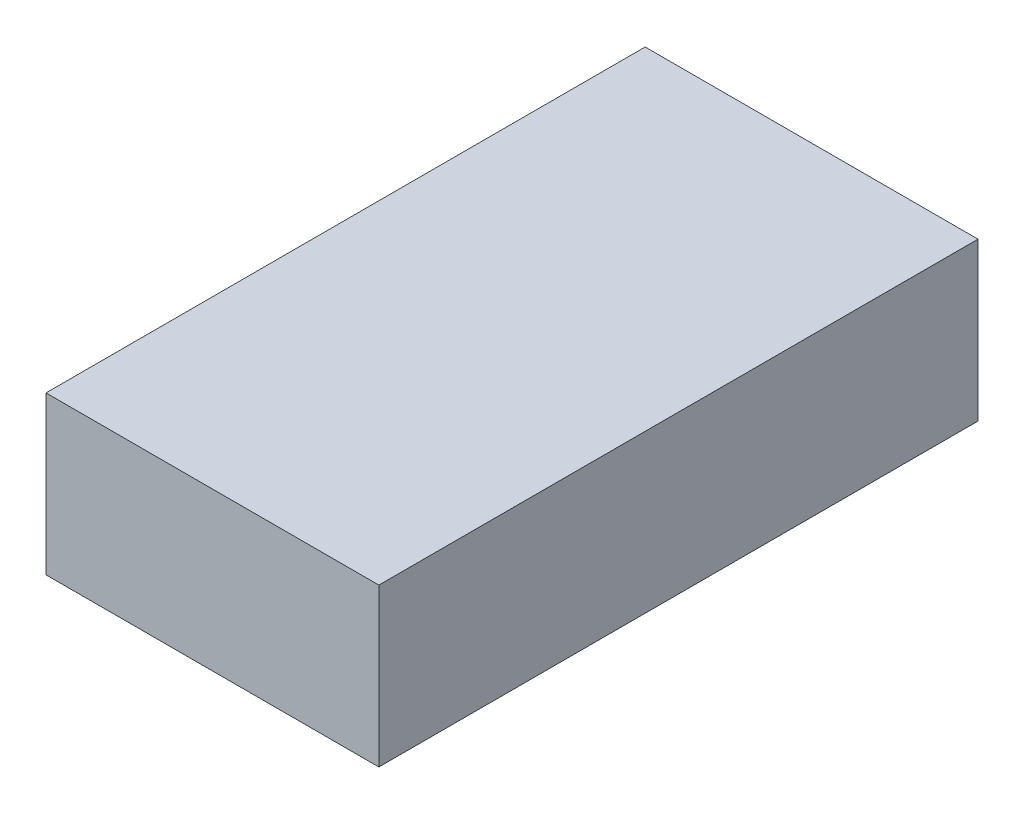
ISO-10303-21;
HEADER;
FILE_DESCRIPTION(('STEP AP214'),'2;1');
FILE_NAME('part.step','',(''),(''),'','','');
FILE_SCHEMA(('AUTOMOTIVE_DESIGN { 1 0 10303 214 1 1 1 1 }'));
ENDSEC;
DATA;
#1=APPLICATION_CONTEXT('core data for automotive mechanical design processes');
#2=APPLICATION_PROTOCOL_DEFINITION('international standard','automotive_design',2000,#1);
#3=PRODUCT_CONTEXT('',#1,'mechanical');
#4=PRODUCT('Part','Part','',(#3));
#5=PRODUCT_RELATED_PRODUCT_CATEGORY('part','',(#4));
#6=PRODUCT_DEFINITION_FORMATION('','',#4);
#7=PRODUCT_DEFINITION_CONTEXT('part definition',#1,'design');
#8=PRODUCT_DEFINITION('design','',#6,#7);
#9=PRODUCT_DEFINITION_SHAPE('','',#8);
#10=(LENGTH_UNIT() NAMED_UNIT(*) SI_UNIT(.MILLI.,.METRE.));
#11=(NAMED_UNIT(*) PLANE_ANGLE_UNIT() SI_UNIT($,.RADIAN.));
#12=(NAMED_UNIT(*) SI_UNIT($,.STERADIAN.) SOLID_ANGLE_UNIT());
#13=UNCERTAINTY_MEASURE_WITH_UNIT(LENGTH_MEASURE(1.E-05),#10,'distance_accuracy_value','');
#14=(GEOMETRIC_REPRESENTATION_CONTEXT(3) GLOBAL_UNCERTAINTY_ASSIGNED_CONTEXT((#13)) GLOBAL_UNIT_ASSIGNED_CONTEXT((#10,
#11,#12)) REPRESENTATION_CONTEXT('',''));
#15=CARTESIAN_POINT('',(0.,0.,0.));
#16=DIRECTION('',(0.,0.,1.));
#17=DIRECTION('',(1.,0.,0.));
#18=AXIS2_PLACEMENT_3D('',#15,#16,#17);
#19=CARTESIAN_POINT('',(0.,18.034,0.));
#20=DIRECTION('',(1.,0.,0.));
#21=DIRECTION('',(0.,0.,-1.));
#22=AXIS2_PLACEMENT_3D('',#19,#20,#21);
#23=PLANE('',#22);
#24=DIRECTION('',(0.,0.,1.));
#25=VECTOR('',#24,1.);
#26=CARTESIAN_POINT('',(0.,0.,0.));
#27=LINE('',#26,#25);
#28=CARTESIAN_POINT('',(0.,0.,-68.58));
#29=VERTEX_POINT('',#28);
#30=CARTESIAN_POINT('',(0.,0.,0.));
#31=VERTEX_POINT('',#30);
#32=EDGE_CURVE('E107',#29,#31,#27,.T.);
#33=ORIENTED_EDGE('',*,*,#32,.T.);
#34=DIRECTION('',(0.,-1.,0.));
#35=VECTOR('',#34,1.);
#36=CARTESIAN_POINT('',(0.,18.034,0.));
#37=LINE('',#36,#35);
#38=CARTESIAN_POINT('',(0.,18.034,0.));
#39=VERTEX_POINT('',#38);
#40=EDGE_CURVE('E11',#39,#31,#37,.T.);
#41=ORIENTED_EDGE('',*,*,#40,.F.);
#42=DIRECTION('',(0.,0.,1.));
#43=VECTOR('',#42,1.);
#44=CARTESIAN_POINT('',(0.,18.034,0.));
#45=LINE('',#44,#43);
#46=CARTESIAN_POINT('',(0.,18.034,-68.58));
#47=VERTEX_POINT('',#46);
#48=EDGE_CURVE('E91',#47,#39,#45,.T.);
#49=ORIENTED_EDGE('',*,*,#48,.F.);
#50=DIRECTION('',(0.,-1.,0.));
#51=VECTOR('',#50,1.);
#52=CARTESIAN_POINT('',(0.,18.034,-68.58));
#53=LINE('',#52,#51);
#54=EDGE_CURVE('E103',#47,#29,#53,.T.);
#55=ORIENTED_EDGE('',*,*,#54,.T.);
#56=EDGE_LOOP('',(#33,#41,#49,#55));
#57=FACE_BOUND('',#56,.T.);
#58=ADVANCED_FACE('F39',(#57),#23,.F.);
#59=CARTESIAN_POINT('',(0.,18.034,0.));
#60=DIRECTION('',(0.,0.,-1.));
#61=DIRECTION('',(-1.,0.,0.));
#62=AXIS2_PLACEMENT_3D('',#59,#60,#61);
#63=PLANE('',#62);
#64=DIRECTION('',(1.,0.,0.));
#65=VECTOR('',#64,1.);
#66=CARTESIAN_POINT('',(0.,0.,0.));
#67=LINE('',#66,#65);
#68=CARTESIAN_POINT('',(38.1,0.,0.));
#69=VERTEX_POINT('',#68);
#70=EDGE_CURVE('E96',#31,#69,#67,.T.);
#71=ORIENTED_EDGE('',*,*,#70,.T.);
#72=DIRECTION('',(0.,-1.,0.));
#73=VECTOR('',#72,1.);
#74=CARTESIAN_POINT('',(38.1,18.034,0.));
#75=LINE('',#74,#73);
#76=CARTESIAN_POINT('',(38.1,18.034,0.));
#77=VERTEX_POINT('',#76);
#78=EDGE_CURVE('E48',#77,#69,#75,.T.);
#79=ORIENTED_EDGE('',*,*,#78,.F.);
#80=DIRECTION('',(1.,0.,0.));
#81=VECTOR('',#80,1.);
#82=CARTESIAN_POINT('',(0.,18.034,0.));
#83=LINE('',#82,#81);
#84=EDGE_CURVE('E86',#39,#77,#83,.T.);
#85=ORIENTED_EDGE('',*,*,#84,.F.);
#86=ORIENTED_EDGE('',*,*,#40,.T.);
#87=EDGE_LOOP('',(#71,#79,#85,#86));
#88=FACE_BOUND('',#87,.T.);
#89=ADVANCED_FACE('F95',(#88),#63,.F.);
#90=CARTESIAN_POINT('',(38.1,18.034,0.));
#91=DIRECTION('',(-1.,0.,0.));
#92=DIRECTION('',(0.,0.,1.));
#93=AXIS2_PLACEMENT_3D('',#90,#91,#92);
#94=PLANE('',#93);
#95=DIRECTION('',(0.,0.,-1.));
#96=VECTOR('',#95,1.);
#97=CARTESIAN_POINT('',(38.1,0.,0.));
#98=LINE('',#97,#96);
#99=CARTESIAN_POINT('',(38.1,0.,-68.58));
#100=VERTEX_POINT('',#99);
#101=EDGE_CURVE('E73',#69,#100,#98,.T.);
#102=ORIENTED_EDGE('',*,*,#101,.T.);
#103=DIRECTION('',(0.,-1.,0.));
#104=VECTOR('',#103,1.);
#105=CARTESIAN_POINT('',(38.1,18.034,-68.58));
#106=LINE('',#105,#104);
#107=CARTESIAN_POINT('',(38.1,18.034,-68.58));
#108=VERTEX_POINT('',#107);
#109=EDGE_CURVE('E98',#108,#100,#106,.T.);
#110=ORIENTED_EDGE('',*,*,#109,.F.);
#111=DIRECTION('',(0.,0.,-1.));
#112=VECTOR('',#111,1.);
#113=CARTESIAN_POINT('',(38.1,18.034,0.));
#114=LINE('',#113,#112);
#115=EDGE_CURVE('E89',#77,#108,#114,.T.);
#116=ORIENTED_EDGE('',*,*,#115,.F.);
#117=ORIENTED_EDGE('',*,*,#78,.T.);
#118=EDGE_LOOP('',(#102,#110,#116,#117));
#119=FACE_BOUND('',#118,.T.);
#120=ADVANCED_FACE('F99',(#119),#94,.F.);
#121=CARTESIAN_POINT('',(0.,18.034,-68.58));
#122=DIRECTION('',(0.,0.,1.));
#123=DIRECTION('',(1.,0.,0.));
#124=AXIS2_PLACEMENT_3D('',#121,#122,#123);
#125=PLANE('',#124);
#126=DIRECTION('',(-1.,0.,0.));
#127=VECTOR('',#126,1.);
#128=CARTESIAN_POINT('',(0.,0.,-68.58));
#129=LINE('',#128,#127);
#130=EDGE_CURVE('E79',#100,#29,#129,.T.);
#131=ORIENTED_EDGE('',*,*,#130,.T.);
#132=ORIENTED_EDGE('',*,*,#54,.F.);
#133=DIRECTION('',(-1.,0.,0.));
#134=VECTOR('',#133,1.);
#135=CARTESIAN_POINT('',(0.,18.034,-68.58));
#136=LINE('',#135,#134);
#137=EDGE_CURVE('E56',#108,#47,#136,.T.);
#138=ORIENTED_EDGE('',*,*,#137,.F.);
#139=ORIENTED_EDGE('',*,*,#109,.T.);
#140=EDGE_LOOP('',(#131,#132,#138,#139));
#141=FACE_BOUND('',#140,.T.);
#142=ADVANCED_FACE('F120',(#141),#125,.F.);
#143=CARTESIAN_POINT('',(0.,18.034,0.));
#144=DIRECTION('',(0.,-1.,0.));
#145=DIRECTION('',(0.,0.,-1.));
#146=AXIS2_PLACEMENT_3D('',#143,#144,#145);
#147=PLANE('',#146);
#148=ORIENTED_EDGE('',*,*,#48,.T.);
#149=ORIENTED_EDGE('',*,*,#84,.T.);
#150=ORIENTED_EDGE('',*,*,#115,.T.);
#151=ORIENTED_EDGE('',*,*,#137,.T.);
#152=EDGE_LOOP('',(#148,#149,#150,#151));
#153=FACE_BOUND('',#152,.T.);
#154=ADVANCED_FACE('F87',(#153),#147,.F.);
#155=CARTESIAN_POINT('',(0.,0.,0.));
#156=DIRECTION('',(0.,-1.,0.));
#157=DIRECTION('',(0.,0.,-1.));
#158=AXIS2_PLACEMENT_3D('',#155,#156,#157);
#159=PLANE('',#158);
#160=ORIENTED_EDGE('',*,*,#32,.F.);
#161=ORIENTED_EDGE('',*,*,#130,.F.);
#162=ORIENTED_EDGE('',*,*,#101,.F.);
#163=ORIENTED_EDGE('',*,*,#70,.F.);
#164=EDGE_LOOP('',(#160,#161,#162,#163));
#165=FACE_BOUND('',#164,.T.);
#166=ADVANCED_FACE('F123',(#165),#159,.T.);
#167=CLOSED_SHELL('',(#58,#89,#120,#142,#154,#166));
#168=MANIFOLD_SOLID_BREP('B2',#167);
#169=ADVANCED_BREP_SHAPE_REPRESENTATION('',(#18,#168),#14);
#170=SHAPE_DEFINITION_REPRESENTATION(#9,#169);
ENDSEC;
END-ISO-10303-21;
